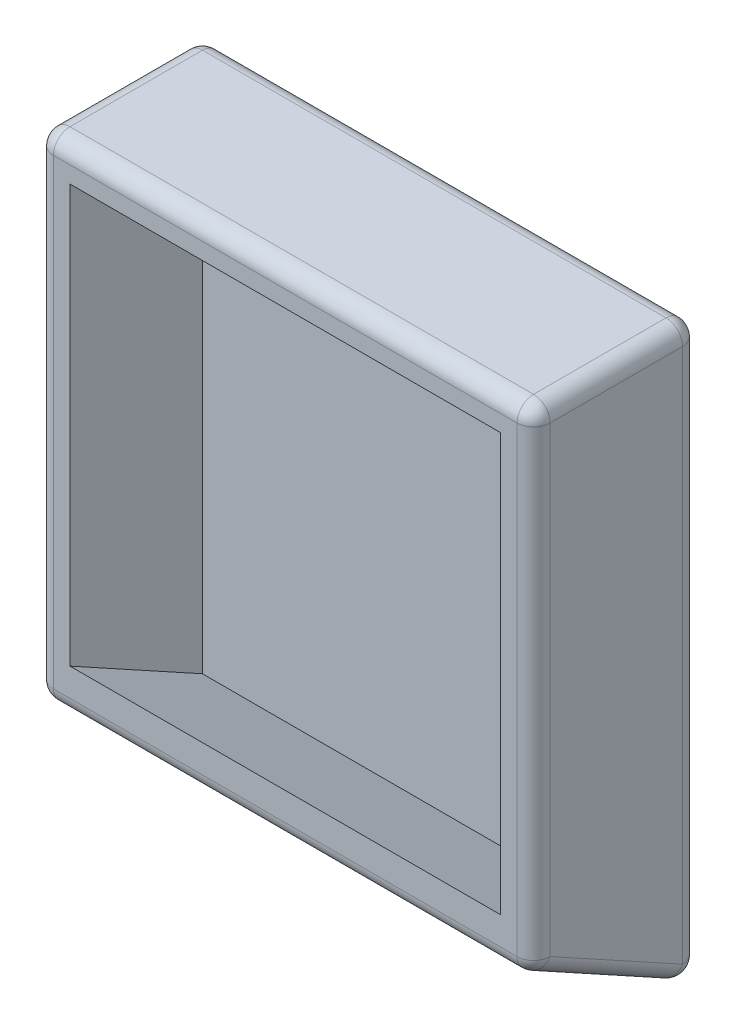
ISO-10303-21;
HEADER;
FILE_DESCRIPTION(('STEP AP214'),'2;1');
FILE_NAME('part.step','',(''),(''),'','','');
FILE_SCHEMA(('AUTOMOTIVE_DESIGN { 1 0 10303 214 1 1 1 1 }'));
ENDSEC;
DATA;
#1=APPLICATION_CONTEXT('core data for automotive mechanical design processes');
#2=APPLICATION_PROTOCOL_DEFINITION('international standard','automotive_design',2000,#1);
#3=PRODUCT_CONTEXT('',#1,'mechanical');
#4=PRODUCT('Part','Part','',(#3));
#5=PRODUCT_RELATED_PRODUCT_CATEGORY('part','',(#4));
#6=PRODUCT_DEFINITION_FORMATION('','',#4);
#7=PRODUCT_DEFINITION_CONTEXT('part definition',#1,'design');
#8=PRODUCT_DEFINITION('design','',#6,#7);
#9=PRODUCT_DEFINITION_SHAPE('','',#8);
#10=(LENGTH_UNIT() NAMED_UNIT(*) SI_UNIT(.MILLI.,.METRE.));
#11=(NAMED_UNIT(*) PLANE_ANGLE_UNIT() SI_UNIT($,.RADIAN.));
#12=(NAMED_UNIT(*) SI_UNIT($,.STERADIAN.) SOLID_ANGLE_UNIT());
#13=UNCERTAINTY_MEASURE_WITH_UNIT(LENGTH_MEASURE(1.E-05),#10,'distance_accuracy_value','');
#14=(GEOMETRIC_REPRESENTATION_CONTEXT(3) GLOBAL_UNCERTAINTY_ASSIGNED_CONTEXT((#13)) GLOBAL_UNIT_ASSIGNED_CONTEXT((#10,
#11,#12)) REPRESENTATION_CONTEXT('',''));
#15=CARTESIAN_POINT('',(0.,0.,0.));
#16=DIRECTION('',(0.,0.,1.));
#17=DIRECTION('',(1.,0.,0.));
#18=AXIS2_PLACEMENT_3D('',#15,#16,#17);
#19=CARTESIAN_POINT('',(0.,0.,100.));
#20=DIRECTION('',(0.,0.,1.));
#21=DIRECTION('',(1.,0.,0.));
#22=AXIS2_PLACEMENT_3D('',#19,#20,#21);
#23=PLANE('',#22);
#24=DIRECTION('',(-1.,0.,0.));
#25=VECTOR('',#24,1.);
#26=CARTESIAN_POINT('',(-150.,165.,100.));
#27=LINE('',#26,#25);
#28=CARTESIAN_POINT('',(140.,165.,100.));
#29=VERTEX_POINT('',#28);
#30=CARTESIAN_POINT('',(-140.,165.,100.));
#31=VERTEX_POINT('',#30);
#32=EDGE_CURVE('E189',#29,#31,#27,.T.);
#33=ORIENTED_EDGE('',*,*,#32,.T.);
#34=DIRECTION('',(0.,-1.,0.));
#35=VECTOR('',#34,1.);
#36=CARTESIAN_POINT('',(-140.,-120.,100.));
#37=LINE('',#36,#35);
#38=CARTESIAN_POINT('',(-140.,-114.087287789487,100.));
#39=VERTEX_POINT('',#38);
#40=EDGE_CURVE('E191',#31,#39,#37,.T.);
#41=ORIENTED_EDGE('',*,*,#40,.T.);
#42=DIRECTION('',(-1.,0.,0.));
#43=VECTOR('',#42,1.);
#44=CARTESIAN_POINT('',(150.,-114.087287789487,100.));
#45=LINE('',#44,#43);
#46=CARTESIAN_POINT('',(140.,-114.087287789487,100.));
#47=VERTEX_POINT('',#46);
#48=EDGE_CURVE('E185',#39,#47,#45,.F.);
#49=ORIENTED_EDGE('',*,*,#48,.T.);
#50=DIRECTION('',(0.,1.,0.));
#51=VECTOR('',#50,1.);
#52=CARTESIAN_POINT('',(140.,175.,100.));
#53=LINE('',#52,#51);
#54=EDGE_CURVE('E187',#47,#29,#53,.T.);
#55=ORIENTED_EDGE('',*,*,#54,.T.);
#56=EDGE_LOOP('',(#33,#41,#49,#55));
#57=FACE_BOUND('',#56,.T.);
#58=DIRECTION('',(0.,1.,0.));
#59=VECTOR('',#58,1.);
#60=CARTESIAN_POINT('',(-130.,0.,100.));
#61=LINE('',#60,#59);
#62=CARTESIAN_POINT('',(-130.,-97.1745755789733,100.));
#63=VERTEX_POINT('',#62);
#64=CARTESIAN_POINT('',(-130.,155.,100.));
#65=VERTEX_POINT('',#64);
#66=EDGE_CURVE('E180',#63,#65,#61,.T.);
#67=ORIENTED_EDGE('',*,*,#66,.T.);
#68=DIRECTION('',(1.,0.,0.));
#69=VECTOR('',#68,1.);
#70=CARTESIAN_POINT('',(0.,155.,100.));
#71=LINE('',#70,#69);
#72=CARTESIAN_POINT('',(130.,155.,100.));
#73=VERTEX_POINT('',#72);
#74=EDGE_CURVE('E158',#65,#73,#71,.T.);
#75=ORIENTED_EDGE('',*,*,#74,.T.);
#76=DIRECTION('',(0.,-1.,0.));
#77=VECTOR('',#76,1.);
#78=CARTESIAN_POINT('',(130.,0.,100.));
#79=LINE('',#78,#77);
#80=CARTESIAN_POINT('',(130.,-97.1745755789733,100.));
#81=VERTEX_POINT('',#80);
#82=EDGE_CURVE('E154',#73,#81,#79,.T.);
#83=ORIENTED_EDGE('',*,*,#82,.T.);
#84=DIRECTION('',(1.,0.,0.));
#85=VECTOR('',#84,1.);
#86=CARTESIAN_POINT('',(150.,-97.1745755789733,100.));
#87=LINE('',#86,#85);
#88=EDGE_CURVE('E50',#63,#81,#87,.T.);
#89=ORIENTED_EDGE('',*,*,#88,.F.);
#90=EDGE_LOOP('',(#67,#75,#83,#89));
#91=FACE_BOUND('',#90,.T.);
#92=ADVANCED_FACE('F33',(#57,#91),#23,.T.);
#93=CARTESIAN_POINT('',(150.,175.,100.));
#94=DIRECTION('',(0.,-1.,0.));
#95=DIRECTION('',(1.,0.,0.));
#96=AXIS2_PLACEMENT_3D('',#93,#94,#95);
#97=PLANE('',#96);
#98=DIRECTION('',(-1.,0.,0.));
#99=VECTOR('',#98,1.);
#100=CARTESIAN_POINT('',(150.,175.,90.));
#101=LINE('',#100,#99);
#102=CARTESIAN_POINT('',(-140.,175.,90.));
#103=VERTEX_POINT('',#102);
#104=CARTESIAN_POINT('',(140.,175.,90.));
#105=VERTEX_POINT('',#104);
#106=EDGE_CURVE('E207',#103,#105,#101,.F.);
#107=ORIENTED_EDGE('',*,*,#106,.T.);
#108=DIRECTION('',(0.,0.,-1.));
#109=VECTOR('',#108,1.);
#110=CARTESIAN_POINT('',(140.,175.,100.));
#111=LINE('',#110,#109);
#112=CARTESIAN_POINT('',(140.,175.,9.99999999999999));
#113=VERTEX_POINT('',#112);
#114=EDGE_CURVE('E210',#105,#113,#111,.T.);
#115=ORIENTED_EDGE('',*,*,#114,.T.);
#116=DIRECTION('',(-1.,0.,0.));
#117=VECTOR('',#116,1.);
#118=CARTESIAN_POINT('',(150.,175.,9.99999999999999));
#119=LINE('',#118,#117);
#120=CARTESIAN_POINT('',(-140.,175.,9.99999999999999));
#121=VERTEX_POINT('',#120);
#122=EDGE_CURVE('E205',#113,#121,#119,.T.);
#123=ORIENTED_EDGE('',*,*,#122,.T.);
#124=DIRECTION('',(0.,0.,-1.));
#125=VECTOR('',#124,1.);
#126=CARTESIAN_POINT('',(-140.,175.,100.));
#127=LINE('',#126,#125);
#128=EDGE_CURVE('E203',#121,#103,#127,.F.);
#129=ORIENTED_EDGE('',*,*,#128,.T.);
#130=EDGE_LOOP('',(#107,#115,#123,#129));
#131=FACE_BOUND('',#130,.T.);
#132=ADVANCED_FACE('F316',(#131),#97,.F.);
#133=CARTESIAN_POINT('',(-150.,175.,100.));
#134=DIRECTION('',(1.,0.,0.));
#135=DIRECTION('',(0.,1.,0.));
#136=AXIS2_PLACEMENT_3D('',#133,#134,#135);
#137=PLANE('',#136);
#138=DIRECTION('',(0.,-1.,0.));
#139=VECTOR('',#138,1.);
#140=CARTESIAN_POINT('',(-150.,175.,90.));
#141=LINE('',#140,#139);
#142=CARTESIAN_POINT('',(-150.,-114.087287789487,90.));
#143=VERTEX_POINT('',#142);
#144=CARTESIAN_POINT('',(-150.,165.,90.));
#145=VERTEX_POINT('',#144);
#146=EDGE_CURVE('E198',#143,#145,#141,.F.);
#147=ORIENTED_EDGE('',*,*,#146,.T.);
#148=DIRECTION('',(0.,0.,-1.));
#149=VECTOR('',#148,1.);
#150=CARTESIAN_POINT('',(-150.,165.,100.));
#151=LINE('',#150,#149);
#152=CARTESIAN_POINT('',(-150.,165.,9.99999999999999));
#153=VERTEX_POINT('',#152);
#154=EDGE_CURVE('E201',#145,#153,#151,.T.);
#155=ORIENTED_EDGE('',*,*,#154,.T.);
#156=DIRECTION('',(0.,-1.,0.));
#157=VECTOR('',#156,1.);
#158=CARTESIAN_POINT('',(-150.,175.,9.99999999999999));
#159=LINE('',#158,#157);
#160=CARTESIAN_POINT('',(-150.,-158.087287789487,9.99999999999999));
#161=VERTEX_POINT('',#160);
#162=EDGE_CURVE('E196',#153,#161,#159,.T.);
#163=ORIENTED_EDGE('',*,*,#162,.T.);
#164=DIRECTION('',(0.,-0.481918749772156,-0.876215908676647));
#165=VECTOR('',#164,1.);
#166=CARTESIAN_POINT('',(-150.,-42.725364905556,219.748950698056));
#167=LINE('',#166,#165);
#168=EDGE_CURVE('E194',#161,#143,#167,.F.);
#169=ORIENTED_EDGE('',*,*,#168,.T.);
#170=EDGE_LOOP('',(#147,#155,#163,#169));
#171=FACE_BOUND('',#170,.T.);
#172=ADVANCED_FACE('F363',(#171),#137,.F.);
#173=CARTESIAN_POINT('',(150.,-175.,100.));
#174=DIRECTION('',(-1.,0.,0.));
#175=DIRECTION('',(0.,0.,1.));
#176=AXIS2_PLACEMENT_3D('',#173,#174,#175);
#177=PLANE('',#176);
#178=DIRECTION('',(0.,1.,0.));
#179=VECTOR('',#178,1.);
#180=CARTESIAN_POINT('',(150.,-175.,9.99999999999999));
#181=LINE('',#180,#179);
#182=CARTESIAN_POINT('',(150.,-158.087287789487,9.99999999999999));
#183=VERTEX_POINT('',#182);
#184=CARTESIAN_POINT('',(150.,165.,9.99999999999999));
#185=VERTEX_POINT('',#184);
#186=EDGE_CURVE('E214',#183,#185,#181,.T.);
#187=ORIENTED_EDGE('',*,*,#186,.T.);
#188=DIRECTION('',(0.,0.,-1.));
#189=VECTOR('',#188,1.);
#190=CARTESIAN_POINT('',(150.,165.,100.));
#191=LINE('',#190,#189);
#192=CARTESIAN_POINT('',(150.,165.,90.));
#193=VERTEX_POINT('',#192);
#194=EDGE_CURVE('E219',#185,#193,#191,.F.);
#195=ORIENTED_EDGE('',*,*,#194,.T.);
#196=DIRECTION('',(0.,1.,0.));
#197=VECTOR('',#196,1.);
#198=CARTESIAN_POINT('',(150.,-120.,90.));
#199=LINE('',#198,#197);
#200=CARTESIAN_POINT('',(150.,-114.087287789487,90.));
#201=VERTEX_POINT('',#200);
#202=EDGE_CURVE('E216',#193,#201,#199,.F.);
#203=ORIENTED_EDGE('',*,*,#202,.T.);
#204=DIRECTION('',(0.,-0.481918749772156,-0.876215908676647));
#205=VECTOR('',#204,1.);
#206=CARTESIAN_POINT('',(150.,-124.011353389241,71.9562443640826));
#207=LINE('',#206,#205);
#208=EDGE_CURVE('E212',#201,#183,#207,.T.);
#209=ORIENTED_EDGE('',*,*,#208,.T.);
#210=EDGE_LOOP('',(#187,#195,#203,#209));
#211=FACE_BOUND('',#210,.T.);
#212=ADVANCED_FACE('F325',(#211),#177,.F.);
#213=CARTESIAN_POINT('',(0.,0.,0.));
#214=DIRECTION('',(0.,0.,1.));
#215=DIRECTION('',(1.,0.,0.));
#216=AXIS2_PLACEMENT_3D('',#213,#214,#215);
#217=PLANE('',#216);
#218=DIRECTION('',(1.,0.,0.));
#219=VECTOR('',#218,1.);
#220=CARTESIAN_POINT('',(0.,-158.087287789487,0.));
#221=LINE('',#220,#219);
#222=CARTESIAN_POINT('',(140.,-158.087287789487,0.));
#223=VERTEX_POINT('',#222);
#224=CARTESIAN_POINT('',(-140.,-158.087287789487,0.));
#225=VERTEX_POINT('',#224);
#226=EDGE_CURVE('E42',#223,#225,#221,.F.);
#227=ORIENTED_EDGE('',*,*,#226,.T.);
#228=DIRECTION('',(0.,-1.,0.));
#229=VECTOR('',#228,1.);
#230=CARTESIAN_POINT('',(-140.,0.,0.));
#231=LINE('',#230,#229);
#232=CARTESIAN_POINT('',(-140.,165.,0.));
#233=VERTEX_POINT('',#232);
#234=EDGE_CURVE('E11',#225,#233,#231,.F.);
#235=ORIENTED_EDGE('',*,*,#234,.T.);
#236=DIRECTION('',(-1.,0.,0.));
#237=VECTOR('',#236,1.);
#238=CARTESIAN_POINT('',(0.,165.,0.));
#239=LINE('',#238,#237);
#240=CARTESIAN_POINT('',(140.,165.,0.));
#241=VERTEX_POINT('',#240);
#242=EDGE_CURVE('E230',#233,#241,#239,.F.);
#243=ORIENTED_EDGE('',*,*,#242,.T.);
#244=DIRECTION('',(0.,1.,0.));
#245=VECTOR('',#244,1.);
#246=CARTESIAN_POINT('',(140.,0.,0.));
#247=LINE('',#246,#245);
#248=EDGE_CURVE('E232',#241,#223,#247,.F.);
#249=ORIENTED_EDGE('',*,*,#248,.T.);
#250=EDGE_LOOP('',(#227,#235,#243,#249));
#251=FACE_BOUND('',#250,.T.);
#252=ADVANCED_FACE('F353',(#251),#217,.F.);
#253=CARTESIAN_POINT('',(150.,-175.,0.));
#254=DIRECTION('',(0.,0.876215908676647,-0.481918749772156));
#255=DIRECTION('',(0.,0.481918749772156,0.876215908676647));
#256=AXIS2_PLACEMENT_3D('',#253,#254,#255);
#257=PLANE('',#256);
#258=DIRECTION('',(-1.,0.,0.));
#259=VECTOR('',#258,1.);
#260=CARTESIAN_POINT('',(-150.,-122.849446876253,94.8191874977216));
#261=LINE('',#260,#259);
#262=CARTESIAN_POINT('',(140.,-122.849446876253,94.8191874977216));
#263=VERTEX_POINT('',#262);
#264=CARTESIAN_POINT('',(-140.,-122.849446876253,94.8191874977216));
#265=VERTEX_POINT('',#264);
#266=EDGE_CURVE('E225',#263,#265,#261,.T.);
#267=ORIENTED_EDGE('',*,*,#266,.T.);
#268=DIRECTION('',(0.,-0.481918749772156,-0.876215908676647));
#269=VECTOR('',#268,1.);
#270=CARTESIAN_POINT('',(-140.,-175.,0.));
#271=LINE('',#270,#269);
#272=CARTESIAN_POINT('',(-140.,-166.849446876253,14.8191874977216));
#273=VERTEX_POINT('',#272);
#274=EDGE_CURVE('E228',#265,#273,#271,.T.);
#275=ORIENTED_EDGE('',*,*,#274,.T.);
#276=DIRECTION('',(1.,0.,0.));
#277=VECTOR('',#276,1.);
#278=CARTESIAN_POINT('',(150.,-166.849446876253,14.8191874977216));
#279=LINE('',#278,#277);
#280=CARTESIAN_POINT('',(140.,-166.849446876253,14.8191874977216));
#281=VERTEX_POINT('',#280);
#282=EDGE_CURVE('E223',#273,#281,#279,.T.);
#283=ORIENTED_EDGE('',*,*,#282,.T.);
#284=DIRECTION('',(0.,-0.481918749772156,-0.876215908676647));
#285=VECTOR('',#284,1.);
#286=CARTESIAN_POINT('',(140.,-175.,0.));
#287=LINE('',#286,#285);
#288=EDGE_CURVE('E221',#281,#263,#287,.F.);
#289=ORIENTED_EDGE('',*,*,#288,.T.);
#290=EDGE_LOOP('',(#267,#275,#283,#289));
#291=FACE_BOUND('',#290,.T.);
#292=ADVANCED_FACE('F355',(#291),#257,.F.);
#293=CARTESIAN_POINT('',(140.,-175.,9.99999999999999));
#294=DIRECTION('',(0.,1.,0.));
#295=DIRECTION('',(0.,0.,1.));
#296=AXIS2_PLACEMENT_3D('',#293,#294,#295);
#297=CYLINDRICAL_SURFACE('',#296,10.);
#298=CARTESIAN_POINT('',(140.,165.,9.99999999999999));
#299=DIRECTION('',(0.,1.,0.));
#300=DIRECTION('',(0.,0.,1.));
#301=AXIS2_PLACEMENT_3D('',#298,#299,#300);
#302=CIRCLE('',#301,10.);
#303=EDGE_CURVE('E37',#185,#241,#302,.T.);
#304=ORIENTED_EDGE('',*,*,#303,.F.);
#305=ORIENTED_EDGE('',*,*,#186,.F.);
#306=CARTESIAN_POINT('',(140.,-158.087287789487,10.));
#307=DIRECTION('',(0.,-1.,0.));
#308=DIRECTION('',(1.,0.,0.));
#309=AXIS2_PLACEMENT_3D('',#306,#307,#308);
#310=CIRCLE('',#309,10.);
#311=EDGE_CURVE('E293',#223,#183,#310,.T.);
#312=ORIENTED_EDGE('',*,*,#311,.F.);
#313=ORIENTED_EDGE('',*,*,#248,.F.);
#314=EDGE_LOOP('',(#304,#305,#312,#313));
#315=FACE_BOUND('',#314,.T.);
#316=ADVANCED_FACE('F35',(#315),#297,.T.);
#317=CARTESIAN_POINT('',(140.,165.,10.));
#318=DIRECTION('',(0.,0.,-1.));
#319=DIRECTION('',(-1.,0.,0.));
#320=AXIS2_PLACEMENT_3D('',#317,#318,#319);
#321=SPHERICAL_SURFACE('',#320,10.);
#322=CARTESIAN_POINT('',(140.,165.,9.99999999999999));
#323=DIRECTION('',(0.,0.,-1.));
#324=DIRECTION('',(-1.,0.,0.));
#325=AXIS2_PLACEMENT_3D('',#322,#323,#324);
#326=CIRCLE('',#325,10.);
#327=EDGE_CURVE('E288',#185,#113,#326,.F.);
#328=ORIENTED_EDGE('',*,*,#327,.F.);
#329=ORIENTED_EDGE('',*,*,#303,.T.);
#330=CARTESIAN_POINT('',(140.,165.,10.));
#331=DIRECTION('',(1.,0.,0.));
#332=DIRECTION('',(0.,0.,-1.));
#333=AXIS2_PLACEMENT_3D('',#330,#331,#332);
#334=CIRCLE('',#333,10.);
#335=EDGE_CURVE('E291',#113,#241,#334,.F.);
#336=ORIENTED_EDGE('',*,*,#335,.F.);
#337=EDGE_LOOP('',(#328,#329,#336));
#338=FACE_BOUND('',#337,.T.);
#339=ADVANCED_FACE('F304',(#338),#321,.T.);
#340=CARTESIAN_POINT('',(140.,-158.087287789487,10.));
#341=DIRECTION('',(1.,0.,0.));
#342=DIRECTION('',(0.,0.,-1.));
#343=AXIS2_PLACEMENT_3D('',#340,#341,#342);
#344=SPHERICAL_SURFACE('',#343,10.);
#345=CARTESIAN_POINT('',(140.,-158.087287789487,10.));
#346=DIRECTION('',(1.,0.,0.));
#347=DIRECTION('',(0.,0.,-1.));
#348=AXIS2_PLACEMENT_3D('',#345,#346,#347);
#349=CIRCLE('',#348,10.);
#350=EDGE_CURVE('E282',#223,#281,#349,.F.);
#351=ORIENTED_EDGE('',*,*,#350,.F.);
#352=ORIENTED_EDGE('',*,*,#311,.T.);
#353=CARTESIAN_POINT('',(140.,-158.087287789487,9.99999999999999));
#354=DIRECTION('',(0.,-0.481918749772156,-0.876215908676647));
#355=DIRECTION('',(0.,0.876215908676647,-0.481918749772156));
#356=AXIS2_PLACEMENT_3D('',#353,#354,#355);
#357=CIRCLE('',#356,10.);
#358=EDGE_CURVE('E285',#281,#183,#357,.F.);
#359=ORIENTED_EDGE('',*,*,#358,.F.);
#360=EDGE_LOOP('',(#351,#352,#359));
#361=FACE_BOUND('',#360,.T.);
#362=ADVANCED_FACE('F339',(#361),#344,.T.);
#363=CARTESIAN_POINT('',(150.,165.,9.99999999999999));
#364=DIRECTION('',(-1.,0.,0.));
#365=DIRECTION('',(0.,-1.,0.));
#366=AXIS2_PLACEMENT_3D('',#363,#364,#365);
#367=CYLINDRICAL_SURFACE('',#366,10.);
#368=ORIENTED_EDGE('',*,*,#335,.T.);
#369=ORIENTED_EDGE('',*,*,#242,.F.);
#370=CARTESIAN_POINT('',(-140.,165.,9.99999999999999));
#371=DIRECTION('',(-1.,0.,0.));
#372=DIRECTION('',(0.,0.,1.));
#373=AXIS2_PLACEMENT_3D('',#370,#371,#372);
#374=CIRCLE('',#373,10.);
#375=EDGE_CURVE('E277',#121,#233,#374,.T.);
#376=ORIENTED_EDGE('',*,*,#375,.F.);
#377=ORIENTED_EDGE('',*,*,#122,.F.);
#378=EDGE_LOOP('',(#368,#369,#376,#377));
#379=FACE_BOUND('',#378,.T.);
#380=ADVANCED_FACE('F312',(#379),#367,.T.);
#381=CARTESIAN_POINT('',(140.,165.,100.));
#382=DIRECTION('',(0.,0.,-1.));
#383=DIRECTION('',(-1.,0.,0.));
#384=AXIS2_PLACEMENT_3D('',#381,#382,#383);
#385=CYLINDRICAL_SURFACE('',#384,10.);
#386=ORIENTED_EDGE('',*,*,#327,.T.);
#387=ORIENTED_EDGE('',*,*,#114,.F.);
#388=CARTESIAN_POINT('',(140.,165.,90.));
#389=DIRECTION('',(0.,0.,1.));
#390=DIRECTION('',(1.,0.,0.));
#391=AXIS2_PLACEMENT_3D('',#388,#389,#390);
#392=CIRCLE('',#391,10.);
#393=EDGE_CURVE('E274',#193,#105,#392,.T.);
#394=ORIENTED_EDGE('',*,*,#393,.F.);
#395=ORIENTED_EDGE('',*,*,#194,.F.);
#396=EDGE_LOOP('',(#386,#387,#394,#395));
#397=FACE_BOUND('',#396,.T.);
#398=ADVANCED_FACE('F322',(#397),#385,.T.);
#399=CARTESIAN_POINT('',(140.,0.,90.));
#400=DIRECTION('',(0.,-1.,0.));
#401=DIRECTION('',(0.,0.,-1.));
#402=AXIS2_PLACEMENT_3D('',#399,#400,#401);
#403=CYLINDRICAL_SURFACE('',#402,10.);
#404=CARTESIAN_POINT('',(140.,-114.087287789487,90.));
#405=DIRECTION('',(0.,-1.,0.));
#406=DIRECTION('',(0.,0.,-1.));
#407=AXIS2_PLACEMENT_3D('',#404,#405,#406);
#408=CIRCLE('',#407,10.);
#409=EDGE_CURVE('E268',#201,#47,#408,.T.);
#410=ORIENTED_EDGE('',*,*,#409,.F.);
#411=ORIENTED_EDGE('',*,*,#202,.F.);
#412=CARTESIAN_POINT('',(140.,165.,90.));
#413=DIRECTION('',(0.,1.,0.));
#414=DIRECTION('',(0.,0.,1.));
#415=AXIS2_PLACEMENT_3D('',#412,#413,#414);
#416=CIRCLE('',#415,10.);
#417=EDGE_CURVE('E271',#29,#193,#416,.T.);
#418=ORIENTED_EDGE('',*,*,#417,.F.);
#419=ORIENTED_EDGE('',*,*,#54,.F.);
#420=EDGE_LOOP('',(#410,#411,#418,#419));
#421=FACE_BOUND('',#420,.T.);
#422=ADVANCED_FACE('F329',(#421),#403,.T.);
#423=CARTESIAN_POINT('',(140.,-124.011353389241,71.9562443640827));
#424=DIRECTION('',(0.,-0.481918749772156,-0.876215908676647));
#425=DIRECTION('',(0.,0.876215908676647,-0.481918749772156));
#426=AXIS2_PLACEMENT_3D('',#423,#424,#425);
#427=CYLINDRICAL_SURFACE('',#426,10.);
#428=ORIENTED_EDGE('',*,*,#358,.T.);
#429=ORIENTED_EDGE('',*,*,#208,.F.);
#430=CARTESIAN_POINT('',(140.,-114.087287789487,90.));
#431=DIRECTION('',(0.,0.481918749772156,0.876215908676647));
#432=DIRECTION('',(0.,-0.876215908676647,0.481918749772156));
#433=AXIS2_PLACEMENT_3D('',#430,#431,#432);
#434=CIRCLE('',#433,10.);
#435=EDGE_CURVE('E266',#263,#201,#434,.T.);
#436=ORIENTED_EDGE('',*,*,#435,.F.);
#437=ORIENTED_EDGE('',*,*,#288,.F.);
#438=EDGE_LOOP('',(#428,#429,#436,#437));
#439=FACE_BOUND('',#438,.T.);
#440=ADVANCED_FACE('F337',(#439),#427,.T.);
#441=CARTESIAN_POINT('',(150.,-158.087287789487,10.));
#442=DIRECTION('',(1.,0.,0.));
#443=DIRECTION('',(0.,1.,0.));
#444=AXIS2_PLACEMENT_3D('',#441,#442,#443);
#445=CYLINDRICAL_SURFACE('',#444,10.);
#446=ORIENTED_EDGE('',*,*,#350,.T.);
#447=ORIENTED_EDGE('',*,*,#282,.F.);
#448=CARTESIAN_POINT('',(-140.,-158.087287789487,10.));
#449=DIRECTION('',(-1.,0.,0.));
#450=DIRECTION('',(0.,0.,1.));
#451=AXIS2_PLACEMENT_3D('',#448,#449,#450);
#452=CIRCLE('',#451,10.);
#453=EDGE_CURVE('E263',#225,#273,#452,.T.);
#454=ORIENTED_EDGE('',*,*,#453,.F.);
#455=ORIENTED_EDGE('',*,*,#226,.F.);
#456=EDGE_LOOP('',(#446,#447,#454,#455));
#457=FACE_BOUND('',#456,.T.);
#458=ADVANCED_FACE('F343',(#457),#445,.T.);
#459=CARTESIAN_POINT('',(-140.,175.,9.99999999999999));
#460=DIRECTION('',(0.,-1.,0.));
#461=DIRECTION('',(1.,0.,0.));
#462=AXIS2_PLACEMENT_3D('',#459,#460,#461);
#463=CYLINDRICAL_SURFACE('',#462,10.);
#464=CARTESIAN_POINT('',(-140.,165.,10.));
#465=DIRECTION('',(0.,1.,0.));
#466=DIRECTION('',(0.,0.,1.));
#467=AXIS2_PLACEMENT_3D('',#464,#465,#466);
#468=CIRCLE('',#467,10.);
#469=EDGE_CURVE('E279',#233,#153,#468,.T.);
#470=ORIENTED_EDGE('',*,*,#469,.F.);
#471=ORIENTED_EDGE('',*,*,#234,.F.);
#472=CARTESIAN_POINT('',(-140.,-158.087287789487,9.99999999999999));
#473=DIRECTION('',(0.,-1.,0.));
#474=DIRECTION('',(0.,0.,-1.));
#475=AXIS2_PLACEMENT_3D('',#472,#473,#474);
#476=CIRCLE('',#475,10.);
#477=EDGE_CURVE('E260',#161,#225,#476,.T.);
#478=ORIENTED_EDGE('',*,*,#477,.F.);
#479=ORIENTED_EDGE('',*,*,#162,.F.);
#480=EDGE_LOOP('',(#470,#471,#478,#479));
#481=FACE_BOUND('',#480,.T.);
#482=ADVANCED_FACE('F352',(#481),#463,.T.);
#483=CARTESIAN_POINT('',(-140.,165.,10.));
#484=DIRECTION('',(0.,0.,-1.));
#485=DIRECTION('',(-1.,0.,0.));
#486=AXIS2_PLACEMENT_3D('',#483,#484,#485);
#487=SPHERICAL_SURFACE('',#486,10.);
#488=ORIENTED_EDGE('',*,*,#375,.T.);
#489=ORIENTED_EDGE('',*,*,#469,.T.);
#490=CARTESIAN_POINT('',(-140.,165.,9.99999999999999));
#491=DIRECTION('',(0.,0.,-1.));
#492=DIRECTION('',(-1.,0.,0.));
#493=AXIS2_PLACEMENT_3D('',#490,#491,#492);
#494=CIRCLE('',#493,10.);
#495=EDGE_CURVE('E257',#121,#153,#494,.F.);
#496=ORIENTED_EDGE('',*,*,#495,.F.);
#497=EDGE_LOOP('',(#488,#489,#496));
#498=FACE_BOUND('',#497,.T.);
#499=ADVANCED_FACE('F428',(#498),#487,.T.);
#500=CARTESIAN_POINT('',(140.,165.,90.));
#501=DIRECTION('',(1.,0.,0.));
#502=DIRECTION('',(0.,0.,-1.));
#503=AXIS2_PLACEMENT_3D('',#500,#501,#502);
#504=SPHERICAL_SURFACE('',#503,10.);
#505=ORIENTED_EDGE('',*,*,#417,.T.);
#506=ORIENTED_EDGE('',*,*,#393,.T.);
#507=CARTESIAN_POINT('',(140.,165.,90.));
#508=DIRECTION('',(1.,0.,0.));
#509=DIRECTION('',(0.,0.,-1.));
#510=AXIS2_PLACEMENT_3D('',#507,#508,#509);
#511=CIRCLE('',#510,10.);
#512=EDGE_CURVE('E255',#29,#105,#511,.F.);
#513=ORIENTED_EDGE('',*,*,#512,.F.);
#514=EDGE_LOOP('',(#505,#506,#513));
#515=FACE_BOUND('',#514,.T.);
#516=ADVANCED_FACE('F425',(#515),#504,.T.);
#517=CARTESIAN_POINT('',(140.,-114.087287789487,90.));
#518=DIRECTION('',(1.,0.,0.));
#519=DIRECTION('',(0.,0.,-1.));
#520=AXIS2_PLACEMENT_3D('',#517,#518,#519);
#521=SPHERICAL_SURFACE('',#520,10.);
#522=ORIENTED_EDGE('',*,*,#435,.T.);
#523=ORIENTED_EDGE('',*,*,#409,.T.);
#524=CARTESIAN_POINT('',(140.,-114.087287789487,90.));
#525=DIRECTION('',(1.,0.,0.));
#526=DIRECTION('',(0.,0.,-1.));
#527=AXIS2_PLACEMENT_3D('',#524,#525,#526);
#528=CIRCLE('',#527,10.);
#529=EDGE_CURVE('E252',#263,#47,#528,.F.);
#530=ORIENTED_EDGE('',*,*,#529,.F.);
#531=EDGE_LOOP('',(#522,#523,#530));
#532=FACE_BOUND('',#531,.T.);
#533=ADVANCED_FACE('F422',(#532),#521,.T.);
#534=CARTESIAN_POINT('',(-140.,-158.087287789487,10.));
#535=DIRECTION('',(-1.,0.,0.));
#536=DIRECTION('',(0.,0.,1.));
#537=AXIS2_PLACEMENT_3D('',#534,#535,#536);
#538=SPHERICAL_SURFACE('',#537,10.);
#539=ORIENTED_EDGE('',*,*,#477,.T.);
#540=ORIENTED_EDGE('',*,*,#453,.T.);
#541=CARTESIAN_POINT('',(-140.,-158.087287789487,10.));
#542=DIRECTION('',(0.,-0.481918749772156,-0.876215908676647));
#543=DIRECTION('',(0.,0.876215908676647,-0.481918749772156));
#544=AXIS2_PLACEMENT_3D('',#541,#542,#543);
#545=CIRCLE('',#544,10.);
#546=EDGE_CURVE('E249',#161,#273,#545,.F.);
#547=ORIENTED_EDGE('',*,*,#546,.F.);
#548=EDGE_LOOP('',(#539,#540,#547));
#549=FACE_BOUND('',#548,.T.);
#550=ADVANCED_FACE('F347',(#549),#538,.T.);
#551=CARTESIAN_POINT('',(-140.,165.,100.));
#552=DIRECTION('',(0.,0.,-1.));
#553=DIRECTION('',(-1.,0.,0.));
#554=AXIS2_PLACEMENT_3D('',#551,#552,#553);
#555=CYLINDRICAL_SURFACE('',#554,10.);
#556=ORIENTED_EDGE('',*,*,#495,.T.);
#557=ORIENTED_EDGE('',*,*,#154,.F.);
#558=CARTESIAN_POINT('',(-140.,165.,90.));
#559=DIRECTION('',(0.,0.,1.));
#560=DIRECTION('',(1.,0.,0.));
#561=AXIS2_PLACEMENT_3D('',#558,#559,#560);
#562=CIRCLE('',#561,10.);
#563=EDGE_CURVE('E246',#103,#145,#562,.T.);
#564=ORIENTED_EDGE('',*,*,#563,.F.);
#565=ORIENTED_EDGE('',*,*,#128,.F.);
#566=EDGE_LOOP('',(#556,#557,#564,#565));
#567=FACE_BOUND('',#566,.T.);
#568=ADVANCED_FACE('F415',(#567),#555,.T.);
#569=CARTESIAN_POINT('',(0.,165.,90.));
#570=DIRECTION('',(1.,0.,0.));
#571=DIRECTION('',(0.,1.,0.));
#572=AXIS2_PLACEMENT_3D('',#569,#570,#571);
#573=CYLINDRICAL_SURFACE('',#572,10.);
#574=ORIENTED_EDGE('',*,*,#512,.T.);
#575=ORIENTED_EDGE('',*,*,#106,.F.);
#576=CARTESIAN_POINT('',(-140.,165.,90.));
#577=DIRECTION('',(-1.,0.,0.));
#578=DIRECTION('',(0.,-1.,0.));
#579=AXIS2_PLACEMENT_3D('',#576,#577,#578);
#580=CIRCLE('',#579,10.);
#581=EDGE_CURVE('E243',#31,#103,#580,.T.);
#582=ORIENTED_EDGE('',*,*,#581,.F.);
#583=ORIENTED_EDGE('',*,*,#32,.F.);
#584=EDGE_LOOP('',(#574,#575,#582,#583));
#585=FACE_BOUND('',#584,.T.);
#586=ADVANCED_FACE('F411',(#585),#573,.T.);
#587=CARTESIAN_POINT('',(150.,-114.087287789487,90.));
#588=DIRECTION('',(1.,0.,0.));
#589=DIRECTION('',(0.,1.,0.));
#590=AXIS2_PLACEMENT_3D('',#587,#588,#589);
#591=CYLINDRICAL_SURFACE('',#590,10.);
#592=ORIENTED_EDGE('',*,*,#529,.T.);
#593=ORIENTED_EDGE('',*,*,#48,.F.);
#594=CARTESIAN_POINT('',(-140.,-114.087287789487,90.));
#595=DIRECTION('',(-1.,0.,0.));
#596=DIRECTION('',(0.,0.,1.));
#597=AXIS2_PLACEMENT_3D('',#594,#595,#596);
#598=CIRCLE('',#597,10.);
#599=EDGE_CURVE('E240',#265,#39,#598,.T.);
#600=ORIENTED_EDGE('',*,*,#599,.F.);
#601=ORIENTED_EDGE('',*,*,#266,.F.);
#602=EDGE_LOOP('',(#592,#593,#600,#601));
#603=FACE_BOUND('',#602,.T.);
#604=ADVANCED_FACE('F407',(#603),#591,.T.);
#605=CARTESIAN_POINT('',(-140.,-166.237840913233,-4.81918749772156));
#606=DIRECTION('',(0.,-0.481918749772156,-0.876215908676647));
#607=DIRECTION('',(0.,0.876215908676647,-0.481918749772156));
#608=AXIS2_PLACEMENT_3D('',#605,#606,#607);
#609=CYLINDRICAL_SURFACE('',#608,10.);
#610=ORIENTED_EDGE('',*,*,#546,.T.);
#611=ORIENTED_EDGE('',*,*,#274,.F.);
#612=CARTESIAN_POINT('',(-140.,-114.087287789487,90.));
#613=DIRECTION('',(0.,0.481918749772155,0.876215908676648));
#614=DIRECTION('',(0.,-0.876215908676648,0.481918749772155));
#615=AXIS2_PLACEMENT_3D('',#612,#613,#614);
#616=CIRCLE('',#615,10.);
#617=EDGE_CURVE('E238',#143,#265,#616,.T.);
#618=ORIENTED_EDGE('',*,*,#617,.F.);
#619=ORIENTED_EDGE('',*,*,#168,.F.);
#620=EDGE_LOOP('',(#610,#611,#618,#619));
#621=FACE_BOUND('',#620,.T.);
#622=ADVANCED_FACE('F403',(#621),#609,.T.);
#623=CARTESIAN_POINT('',(-140.,165.,90.));
#624=DIRECTION('',(0.,1.,0.));
#625=DIRECTION('',(0.,0.,1.));
#626=AXIS2_PLACEMENT_3D('',#623,#624,#625);
#627=SPHERICAL_SURFACE('',#626,10.);
#628=ORIENTED_EDGE('',*,*,#581,.T.);
#629=ORIENTED_EDGE('',*,*,#563,.T.);
#630=CARTESIAN_POINT('',(-140.,165.,90.));
#631=DIRECTION('',(0.,1.,0.));
#632=DIRECTION('',(0.,0.,1.));
#633=AXIS2_PLACEMENT_3D('',#630,#631,#632);
#634=CIRCLE('',#633,10.);
#635=EDGE_CURVE('E236',#31,#145,#634,.F.);
#636=ORIENTED_EDGE('',*,*,#635,.F.);
#637=EDGE_LOOP('',(#628,#629,#636));
#638=FACE_BOUND('',#637,.T.);
#639=ADVANCED_FACE('F396',(#638),#627,.T.);
#640=CARTESIAN_POINT('',(-140.,-114.087287789487,90.));
#641=DIRECTION('',(-1.,0.,0.));
#642=DIRECTION('',(0.,-1.,0.));
#643=AXIS2_PLACEMENT_3D('',#640,#641,#642);
#644=SPHERICAL_SURFACE('',#643,10.);
#645=ORIENTED_EDGE('',*,*,#617,.T.);
#646=ORIENTED_EDGE('',*,*,#599,.T.);
#647=CARTESIAN_POINT('',(-140.,-114.087287789487,90.));
#648=DIRECTION('',(0.,-1.,0.));
#649=DIRECTION('',(1.,0.,0.));
#650=AXIS2_PLACEMENT_3D('',#647,#648,#649);
#651=CIRCLE('',#650,10.);
#652=EDGE_CURVE('E183',#143,#39,#651,.F.);
#653=ORIENTED_EDGE('',*,*,#652,.F.);
#654=EDGE_LOOP('',(#645,#646,#653));
#655=FACE_BOUND('',#654,.T.);
#656=ADVANCED_FACE('F390',(#655),#644,.T.);
#657=CARTESIAN_POINT('',(-140.,0.,90.));
#658=DIRECTION('',(0.,1.,0.));
#659=DIRECTION('',(-1.,0.,0.));
#660=AXIS2_PLACEMENT_3D('',#657,#658,#659);
#661=CYLINDRICAL_SURFACE('',#660,10.);
#662=ORIENTED_EDGE('',*,*,#635,.T.);
#663=ORIENTED_EDGE('',*,*,#146,.F.);
#664=ORIENTED_EDGE('',*,*,#652,.T.);
#665=ORIENTED_EDGE('',*,*,#40,.F.);
#666=EDGE_LOOP('',(#662,#663,#664,#665));
#667=FACE_BOUND('',#666,.T.);
#668=ADVANCED_FACE('F386',(#667),#661,.T.);
#669=CARTESIAN_POINT('',(150.,155.,100.));
#670=DIRECTION('',(0.,-1.,0.));
#671=DIRECTION('',(1.,0.,0.));
#672=AXIS2_PLACEMENT_3D('',#669,#670,#671);
#673=PLANE('',#672);
#674=ORIENTED_EDGE('',*,*,#74,.F.);
#675=DIRECTION('',(0.,0.,-1.));
#676=VECTOR('',#675,1.);
#677=CARTESIAN_POINT('',(-130.,155.,100.));
#678=LINE('',#677,#676);
#679=CARTESIAN_POINT('',(-130.,155.,20.));
#680=VERTEX_POINT('',#679);
#681=EDGE_CURVE('E164',#65,#680,#678,.T.);
#682=ORIENTED_EDGE('',*,*,#681,.T.);
#683=DIRECTION('',(1.,0.,0.));
#684=VECTOR('',#683,1.);
#685=CARTESIAN_POINT('',(0.,155.,20.));
#686=LINE('',#685,#684);
#687=CARTESIAN_POINT('',(130.,155.,20.));
#688=VERTEX_POINT('',#687);
#689=EDGE_CURVE('E161',#680,#688,#686,.T.);
#690=ORIENTED_EDGE('',*,*,#689,.T.);
#691=DIRECTION('',(0.,0.,-1.));
#692=VECTOR('',#691,1.);
#693=CARTESIAN_POINT('',(130.,155.,100.));
#694=LINE('',#693,#692);
#695=EDGE_CURVE('E148',#73,#688,#694,.T.);
#696=ORIENTED_EDGE('',*,*,#695,.F.);
#697=EDGE_LOOP('',(#674,#682,#690,#696));
#698=FACE_BOUND('',#697,.T.);
#699=ADVANCED_FACE('F162',(#698),#673,.T.);
#700=CARTESIAN_POINT('',(-130.,175.,100.));
#701=DIRECTION('',(1.,0.,0.));
#702=DIRECTION('',(0.,1.,0.));
#703=AXIS2_PLACEMENT_3D('',#700,#701,#702);
#704=PLANE('',#703);
#705=ORIENTED_EDGE('',*,*,#66,.F.);
#706=DIRECTION('',(0.,-0.481918749772156,-0.876215908676647));
#707=VECTOR('',#706,1.);
#708=CARTESIAN_POINT('',(-130.,-157.475681826467,-9.63837499544312));
#709=LINE('',#708,#707);
#710=CARTESIAN_POINT('',(-130.,-141.174575578973,20.));
#711=VERTEX_POINT('',#710);
#712=EDGE_CURVE('E168',#63,#711,#709,.T.);
#713=ORIENTED_EDGE('',*,*,#712,.T.);
#714=DIRECTION('',(0.,1.,0.));
#715=VECTOR('',#714,1.);
#716=CARTESIAN_POINT('',(-130.,0.,20.));
#717=LINE('',#716,#715);
#718=EDGE_CURVE('E167',#711,#680,#717,.T.);
#719=ORIENTED_EDGE('',*,*,#718,.T.);
#720=ORIENTED_EDGE('',*,*,#681,.F.);
#721=EDGE_LOOP('',(#705,#713,#719,#720));
#722=FACE_BOUND('',#721,.T.);
#723=ADVANCED_FACE('F381',(#722),#704,.T.);
#724=CARTESIAN_POINT('',(130.,-175.,100.));
#725=DIRECTION('',(-1.,0.,0.));
#726=DIRECTION('',(0.,0.,1.));
#727=AXIS2_PLACEMENT_3D('',#724,#725,#726);
#728=PLANE('',#727);
#729=DIRECTION('',(0.,1.,0.));
#730=VECTOR('',#729,1.);
#731=CARTESIAN_POINT('',(130.,-175.,20.));
#732=LINE('',#731,#730);
#733=CARTESIAN_POINT('',(130.,-141.174575578973,20.));
#734=VERTEX_POINT('',#733);
#735=EDGE_CURVE('E152',#734,#688,#732,.T.);
#736=ORIENTED_EDGE('',*,*,#735,.F.);
#737=DIRECTION('',(0.,-0.481918749772156,-0.876215908676647));
#738=VECTOR('',#737,1.);
#739=CARTESIAN_POINT('',(130.,-115.249194302475,67.1370568663611));
#740=LINE('',#739,#738);
#741=EDGE_CURVE('E157',#81,#734,#740,.T.);
#742=ORIENTED_EDGE('',*,*,#741,.F.);
#743=ORIENTED_EDGE('',*,*,#82,.F.);
#744=ORIENTED_EDGE('',*,*,#695,.T.);
#745=EDGE_LOOP('',(#736,#742,#743,#744));
#746=FACE_BOUND('',#745,.T.);
#747=ADVANCED_FACE('F150',(#746),#728,.T.);
#748=CARTESIAN_POINT('',(0.,0.,20.));
#749=DIRECTION('',(0.,0.,1.));
#750=DIRECTION('',(1.,0.,0.));
#751=AXIS2_PLACEMENT_3D('',#748,#749,#750);
#752=PLANE('',#751);
#753=DIRECTION('',(1.,0.,0.));
#754=VECTOR('',#753,1.);
#755=CARTESIAN_POINT('',(150.,-141.174575578973,20.));
#756=LINE('',#755,#754);
#757=EDGE_CURVE('E172',#711,#734,#756,.T.);
#758=ORIENTED_EDGE('',*,*,#757,.T.);
#759=ORIENTED_EDGE('',*,*,#735,.T.);
#760=ORIENTED_EDGE('',*,*,#689,.F.);
#761=ORIENTED_EDGE('',*,*,#718,.F.);
#762=EDGE_LOOP('',(#758,#759,#760,#761));
#763=FACE_BOUND('',#762,.T.);
#764=ADVANCED_FACE('F170',(#763),#752,.T.);
#765=CARTESIAN_POINT('',(150.,-157.475681826467,-9.63837499544312));
#766=DIRECTION('',(0.,0.876215908676647,-0.481918749772156));
#767=DIRECTION('',(0.,0.481918749772156,0.876215908676647));
#768=AXIS2_PLACEMENT_3D('',#765,#766,#767);
#769=PLANE('',#768);
#770=ORIENTED_EDGE('',*,*,#88,.T.);
#771=ORIENTED_EDGE('',*,*,#741,.T.);
#772=ORIENTED_EDGE('',*,*,#757,.F.);
#773=ORIENTED_EDGE('',*,*,#712,.F.);
#774=EDGE_LOOP('',(#770,#771,#772,#773));
#775=FACE_BOUND('',#774,.T.);
#776=ADVANCED_FACE('F374',(#775),#769,.T.);
#777=CLOSED_SHELL('',(#92,#132,#172,#212,#252,#292,#316,#339,#362,#380,#398,#422,#440,#458,#482,
#499,#516,#533,#550,#568,#586,#604,#622,#639,#656,#668,#699,#723,#747,#764,#776));
#778=MANIFOLD_SOLID_BREP('B2',#777);
#779=ADVANCED_BREP_SHAPE_REPRESENTATION('',(#18,#778),#14);
#780=SHAPE_DEFINITION_REPRESENTATION(#9,#779);
ENDSEC;
END-ISO-10303-21;
